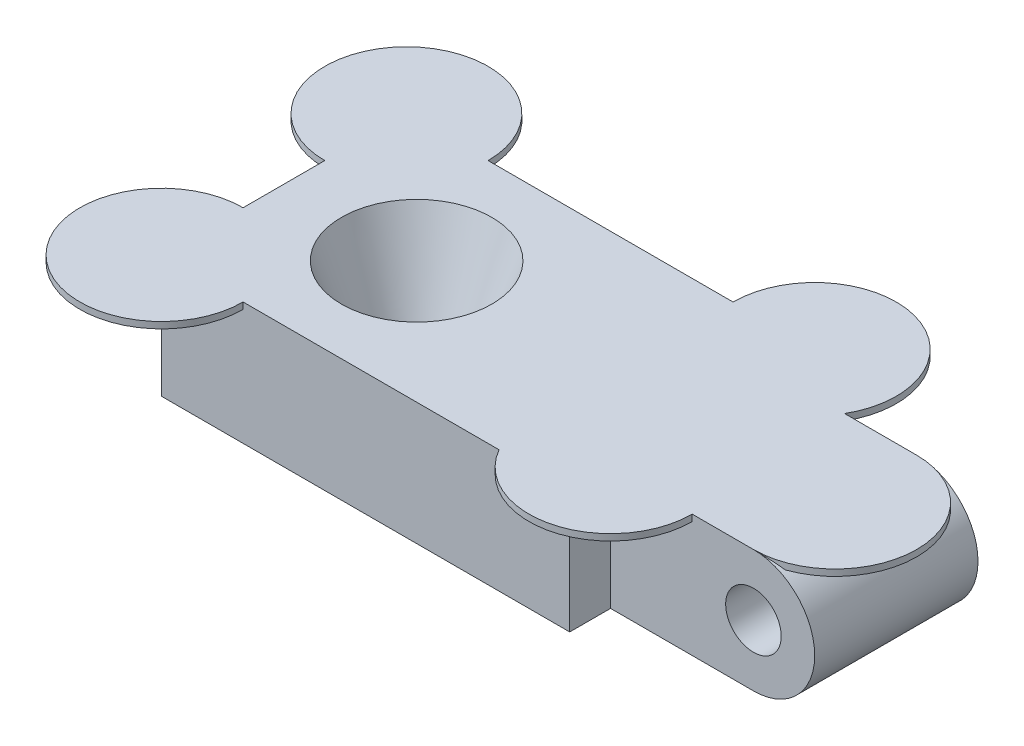
ISO-10303-21;
HEADER;
FILE_DESCRIPTION(('STEP AP214'),'2;1');
FILE_NAME('part.step','',(''),(''),'','','');
FILE_SCHEMA(('AUTOMOTIVE_DESIGN { 1 0 10303 214 1 1 1 1 }'));
ENDSEC;
DATA;
#1=APPLICATION_CONTEXT('core data for automotive mechanical design processes');
#2=APPLICATION_PROTOCOL_DEFINITION('international standard','automotive_design',2000,#1);
#3=PRODUCT_CONTEXT('',#1,'mechanical');
#4=PRODUCT('Part','Part','',(#3));
#5=PRODUCT_RELATED_PRODUCT_CATEGORY('part','',(#4));
#6=PRODUCT_DEFINITION_FORMATION('','',#4);
#7=PRODUCT_DEFINITION_CONTEXT('part definition',#1,'design');
#8=PRODUCT_DEFINITION('design','',#6,#7);
#9=PRODUCT_DEFINITION_SHAPE('','',#8);
#10=(LENGTH_UNIT() NAMED_UNIT(*) SI_UNIT(.MILLI.,.METRE.));
#11=(NAMED_UNIT(*) PLANE_ANGLE_UNIT() SI_UNIT($,.RADIAN.));
#12=(NAMED_UNIT(*) SI_UNIT($,.STERADIAN.) SOLID_ANGLE_UNIT());
#13=UNCERTAINTY_MEASURE_WITH_UNIT(LENGTH_MEASURE(1.E-05),#10,'distance_accuracy_value','');
#14=(GEOMETRIC_REPRESENTATION_CONTEXT(3) GLOBAL_UNCERTAINTY_ASSIGNED_CONTEXT((#13)) GLOBAL_UNIT_ASSIGNED_CONTEXT((#10,
#11,#12)) REPRESENTATION_CONTEXT('',''));
#15=CARTESIAN_POINT('',(0.,0.,0.));
#16=DIRECTION('',(0.,0.,1.));
#17=DIRECTION('',(1.,0.,0.));
#18=AXIS2_PLACEMENT_3D('',#15,#16,#17);
#19=CARTESIAN_POINT('',(8.255,3.81,10.16));
#20=DIRECTION('',(1.,0.,0.));
#21=DIRECTION('',(0.,0.,-1.));
#22=AXIS2_PLACEMENT_3D('',#19,#20,#21);
#23=PLANE('',#22);
#24=DIRECTION('',(0.,-1.,0.));
#25=VECTOR('',#24,1.);
#26=CARTESIAN_POINT('',(8.255,3.81,10.16));
#27=LINE('',#26,#25);
#28=CARTESIAN_POINT('',(8.255,3.41,10.16));
#29=VERTEX_POINT('',#28);
#30=CARTESIAN_POINT('',(8.255,-3.81,10.16));
#31=VERTEX_POINT('',#30);
#32=EDGE_CURVE('E249',#29,#31,#27,.T.);
#33=ORIENTED_EDGE('',*,*,#32,.F.);
#34=DIRECTION('',(0.,0.,1.));
#35=VECTOR('',#34,1.);
#36=CARTESIAN_POINT('',(8.255,3.41,10.16));
#37=LINE('',#36,#35);
#38=CARTESIAN_POINT('',(8.255,3.41,12.7));
#39=VERTEX_POINT('',#38);
#40=EDGE_CURVE('E42',#29,#39,#37,.T.);
#41=ORIENTED_EDGE('',*,*,#40,.T.);
#42=DIRECTION('',(0.,-1.,0.));
#43=VECTOR('',#42,1.);
#44=CARTESIAN_POINT('',(8.255,3.81,12.7));
#45=LINE('',#44,#43);
#46=CARTESIAN_POINT('',(8.255,-3.81,12.7));
#47=VERTEX_POINT('',#46);
#48=EDGE_CURVE('E255',#39,#47,#45,.T.);
#49=ORIENTED_EDGE('',*,*,#48,.T.);
#50=DIRECTION('',(0.,0.,1.));
#51=VECTOR('',#50,1.);
#52=CARTESIAN_POINT('',(8.255,-3.81,10.16));
#53=LINE('',#52,#51);
#54=EDGE_CURVE('E202',#31,#47,#53,.T.);
#55=ORIENTED_EDGE('',*,*,#54,.F.);
#56=EDGE_LOOP('',(#33,#41,#49,#55));
#57=FACE_BOUND('',#56,.T.);
#58=ADVANCED_FACE('F33',(#57),#23,.T.);
#59=CARTESIAN_POINT('',(8.25499999999998,3.81,0.));
#60=DIRECTION('',(1.,0.,0.));
#61=DIRECTION('',(0.,0.,-1.));
#62=AXIS2_PLACEMENT_3D('',#59,#60,#61);
#63=PLANE('',#62);
#64=DIRECTION('',(0.,-1.,0.));
#65=VECTOR('',#64,1.);
#66=CARTESIAN_POINT('',(8.25499999999998,3.81,-2.54));
#67=LINE('',#66,#65);
#68=CARTESIAN_POINT('',(8.25499999999998,3.41,-2.54));
#69=VERTEX_POINT('',#68);
#70=CARTESIAN_POINT('',(8.25499999999998,-3.81,-2.54));
#71=VERTEX_POINT('',#70);
#72=EDGE_CURVE('E236',#69,#71,#67,.T.);
#73=ORIENTED_EDGE('',*,*,#72,.F.);
#74=DIRECTION('',(0.,0.,1.));
#75=VECTOR('',#74,1.);
#76=CARTESIAN_POINT('',(8.25499999999998,3.41,0.));
#77=LINE('',#76,#75);
#78=CARTESIAN_POINT('',(8.25499999999998,3.41,0.));
#79=VERTEX_POINT('',#78);
#80=EDGE_CURVE('E309',#69,#79,#77,.T.);
#81=ORIENTED_EDGE('',*,*,#80,.T.);
#82=DIRECTION('',(0.,-1.,0.));
#83=VECTOR('',#82,1.);
#84=CARTESIAN_POINT('',(8.25499999999998,3.81,0.));
#85=LINE('',#84,#83);
#86=CARTESIAN_POINT('',(8.25499999999998,-3.81,0.));
#87=VERTEX_POINT('',#86);
#88=EDGE_CURVE('E206',#79,#87,#85,.T.);
#89=ORIENTED_EDGE('',*,*,#88,.T.);
#90=DIRECTION('',(0.,0.,1.));
#91=VECTOR('',#90,1.);
#92=CARTESIAN_POINT('',(8.25499999999998,-3.81,0.));
#93=LINE('',#92,#91);
#94=EDGE_CURVE('E317',#71,#87,#93,.T.);
#95=ORIENTED_EDGE('',*,*,#94,.F.);
#96=EDGE_LOOP('',(#73,#81,#89,#95));
#97=FACE_BOUND('',#96,.T.);
#98=ADVANCED_FACE('F325',(#97),#63,.T.);
#99=CARTESIAN_POINT('',(-8.89,-3.81,5.08));
#100=DIRECTION('',(0.,1.,0.));
#101=DIRECTION('',(0.,0.,1.));
#102=AXIS2_PLACEMENT_3D('',#99,#100,#101);
#103=CONICAL_SURFACE('',#102,1.905,0.349065850398867);
#104=CARTESIAN_POINT('',(-8.89,3.81,5.08));
#105=DIRECTION('',(0.,1.,0.));
#106=DIRECTION('',(0.,0.,1.));
#107=AXIS2_PLACEMENT_3D('',#104,#105,#106);
#108=CIRCLE('',#107,4.67845318510847);
#109=CARTESIAN_POINT('',(-8.89,3.81,9.75845318510847));
#110=VERTEX_POINT('',#109);
#111=EDGE_CURVE('E339',#110,#110,#108,.T.);
#112=ORIENTED_EDGE('',*,*,#111,.T.);
#113=EDGE_LOOP('',(#112));
#114=FACE_BOUND('',#113,.T.);
#115=CARTESIAN_POINT('',(-8.89,-2.54,5.08));
#116=DIRECTION('',(0.,-1.,0.));
#117=DIRECTION('',(0.,0.,-1.));
#118=AXIS2_PLACEMENT_3D('',#115,#116,#117);
#119=CIRCLE('',#118,2.36724219751808);
#120=CARTESIAN_POINT('',(-8.89,-2.54,2.71275780248192));
#121=VERTEX_POINT('',#120);
#122=EDGE_CURVE('E198',#121,#121,#119,.T.);
#123=ORIENTED_EDGE('',*,*,#122,.T.);
#124=EDGE_LOOP('',(#123));
#125=FACE_BOUND('',#124,.T.);
#126=ADVANCED_FACE('F353',(#114,#125),#103,.F.);
#127=CARTESIAN_POINT('',(-17.145,3.81,10.16));
#128=DIRECTION('',(0.,-1.,0.));
#129=DIRECTION('',(0.,0.,-1.));
#130=AXIS2_PLACEMENT_3D('',#127,#128,#129);
#131=PLANE('',#130);
#132=DIRECTION('',(-1.,0.,0.));
#133=VECTOR('',#132,1.);
#134=CARTESIAN_POINT('',(-17.145,3.81,10.16));
#135=LINE('',#134,#133);
#136=CARTESIAN_POINT('',(17.145,3.81,10.16));
#137=VERTEX_POINT('',#136);
#138=CARTESIAN_POINT('',(13.335,3.81,10.16));
#139=VERTEX_POINT('',#138);
#140=EDGE_CURVE('E54',#137,#139,#135,.T.);
#141=ORIENTED_EDGE('',*,*,#140,.F.);
#142=CARTESIAN_POINT('',(17.145,3.81,5.08));
#143=DIRECTION('',(0.,1.,0.));
#144=DIRECTION('',(0.,0.,1.));
#145=AXIS2_PLACEMENT_3D('',#142,#143,#144);
#146=CIRCLE('',#145,5.08);
#147=CARTESIAN_POINT('',(17.145,3.81,0.));
#148=VERTEX_POINT('',#147);
#149=EDGE_CURVE('E151',#137,#148,#146,.T.);
#150=ORIENTED_EDGE('',*,*,#149,.T.);
#151=DIRECTION('',(-1.,0.,0.));
#152=VECTOR('',#151,1.);
#153=CARTESIAN_POINT('',(-17.145,3.81,0.));
#154=LINE('',#153,#152);
#155=CARTESIAN_POINT('',(12.6544090512249,3.81,0.));
#156=VERTEX_POINT('',#155);
#157=EDGE_CURVE('E186',#148,#156,#154,.T.);
#158=ORIENTED_EDGE('',*,*,#157,.T.);
#159=CARTESIAN_POINT('',(8.25499999999998,3.81,-2.54));
#160=DIRECTION('',(0.,1.,0.));
#161=DIRECTION('',(0.,0.,1.));
#162=AXIS2_PLACEMENT_3D('',#159,#160,#161);
#163=CIRCLE('',#162,5.08);
#164=CARTESIAN_POINT('',(3.17499999999998,3.81,-2.54));
#165=VERTEX_POINT('',#164);
#166=EDGE_CURVE('E300',#156,#165,#163,.T.);
#167=ORIENTED_EDGE('',*,*,#166,.T.);
#168=DIRECTION('',(1.,0.,0.));
#169=VECTOR('',#168,1.);
#170=CARTESIAN_POINT('',(-17.145,3.81,-2.54));
#171=LINE('',#170,#169);
#172=CARTESIAN_POINT('',(-12.065,3.81,-2.54));
#173=VERTEX_POINT('',#172);
#174=EDGE_CURVE('E246',#173,#165,#171,.T.);
#175=ORIENTED_EDGE('',*,*,#174,.F.);
#176=CARTESIAN_POINT('',(-17.145,3.81,-2.54));
#177=DIRECTION('',(0.,1.,0.));
#178=DIRECTION('',(0.,0.,1.));
#179=AXIS2_PLACEMENT_3D('',#176,#177,#178);
#180=CIRCLE('',#179,5.08);
#181=CARTESIAN_POINT('',(-17.145,3.81,2.54));
#182=VERTEX_POINT('',#181);
#183=EDGE_CURVE('E428',#173,#182,#180,.T.);
#184=ORIENTED_EDGE('',*,*,#183,.T.);
#185=DIRECTION('',(0.,0.,-1.));
#186=VECTOR('',#185,1.);
#187=CARTESIAN_POINT('',(-17.145,3.81,10.16));
#188=LINE('',#187,#186);
#189=CARTESIAN_POINT('',(-17.145,3.81,7.62));
#190=VERTEX_POINT('',#189);
#191=EDGE_CURVE('E218',#190,#182,#188,.T.);
#192=ORIENTED_EDGE('',*,*,#191,.F.);
#193=CARTESIAN_POINT('',(-17.145,3.81,12.7));
#194=DIRECTION('',(0.,1.,0.));
#195=DIRECTION('',(0.,0.,1.));
#196=AXIS2_PLACEMENT_3D('',#193,#194,#195);
#197=CIRCLE('',#196,5.08);
#198=CARTESIAN_POINT('',(-12.065,3.81,12.7));
#199=VERTEX_POINT('',#198);
#200=EDGE_CURVE('E302',#190,#199,#197,.T.);
#201=ORIENTED_EDGE('',*,*,#200,.T.);
#202=DIRECTION('',(-1.,0.,0.));
#203=VECTOR('',#202,1.);
#204=CARTESIAN_POINT('',(-17.145,3.81,12.7));
#205=LINE('',#204,#203);
#206=CARTESIAN_POINT('',(3.85559094877505,3.81,12.7));
#207=VERTEX_POINT('',#206);
#208=EDGE_CURVE('E247',#207,#199,#205,.T.);
#209=ORIENTED_EDGE('',*,*,#208,.F.);
#210=CARTESIAN_POINT('',(8.255,3.81,10.16));
#211=DIRECTION('',(0.,1.,0.));
#212=DIRECTION('',(0.,0.,1.));
#213=AXIS2_PLACEMENT_3D('',#210,#211,#212);
#214=CIRCLE('',#213,5.08);
#215=EDGE_CURVE('E171',#207,#139,#214,.T.);
#216=ORIENTED_EDGE('',*,*,#215,.T.);
#217=EDGE_LOOP('',(#141,#150,#158,#167,#175,#184,#192,#201,#209,#216));
#218=FACE_BOUND('',#217,.T.);
#219=ORIENTED_EDGE('',*,*,#111,.F.);
#220=EDGE_LOOP('',(#219));
#221=FACE_BOUND('',#220,.T.);
#222=ADVANCED_FACE('F174',(#218,#221),#131,.F.);
#223=CARTESIAN_POINT('',(-17.145,-3.81,10.16));
#224=DIRECTION('',(0.,1.,0.));
#225=DIRECTION('',(0.,0.,1.));
#226=AXIS2_PLACEMENT_3D('',#223,#224,#225);
#227=PLANE('',#226);
#228=CARTESIAN_POINT('',(-8.89,-3.81,5.08));
#229=DIRECTION('',(0.,-1.,0.));
#230=DIRECTION('',(0.,0.,-1.));
#231=AXIS2_PLACEMENT_3D('',#228,#229,#230);
#232=CIRCLE('',#231,4.1275);
#233=CARTESIAN_POINT('',(-8.89,-3.81,0.9525));
#234=VERTEX_POINT('',#233);
#235=EDGE_CURVE('E254',#234,#234,#232,.T.);
#236=ORIENTED_EDGE('',*,*,#235,.F.);
#237=EDGE_LOOP('',(#236));
#238=FACE_BOUND('',#237,.T.);
#239=DIRECTION('',(0.,0.,-1.));
#240=VECTOR('',#239,1.);
#241=CARTESIAN_POINT('',(-17.145,-3.81,10.16));
#242=LINE('',#241,#240);
#243=CARTESIAN_POINT('',(-17.145,-3.81,12.7));
#244=VERTEX_POINT('',#243);
#245=CARTESIAN_POINT('',(-17.145,-3.81,-2.54));
#246=VERTEX_POINT('',#245);
#247=EDGE_CURVE('E216',#244,#246,#242,.T.);
#248=ORIENTED_EDGE('',*,*,#247,.T.);
#249=DIRECTION('',(1.,0.,0.));
#250=VECTOR('',#249,1.);
#251=CARTESIAN_POINT('',(-17.145,-3.81,-2.54));
#252=LINE('',#251,#250);
#253=EDGE_CURVE('E241',#246,#71,#252,.T.);
#254=ORIENTED_EDGE('',*,*,#253,.T.);
#255=ORIENTED_EDGE('',*,*,#94,.T.);
#256=DIRECTION('',(1.,0.,0.));
#257=VECTOR('',#256,1.);
#258=CARTESIAN_POINT('',(-17.145,-3.81,0.));
#259=LINE('',#258,#257);
#260=CARTESIAN_POINT('',(17.145,-3.81,0.));
#261=VERTEX_POINT('',#260);
#262=EDGE_CURVE('E184',#87,#261,#259,.T.);
#263=ORIENTED_EDGE('',*,*,#262,.T.);
#264=DIRECTION('',(0.,0.,-1.));
#265=VECTOR('',#264,1.);
#266=CARTESIAN_POINT('',(17.145,-3.81,10.16));
#267=LINE('',#266,#265);
#268=CARTESIAN_POINT('',(17.145,-3.81,10.16));
#269=VERTEX_POINT('',#268);
#270=EDGE_CURVE('E201',#269,#261,#267,.T.);
#271=ORIENTED_EDGE('',*,*,#270,.F.);
#272=DIRECTION('',(1.,0.,0.));
#273=VECTOR('',#272,1.);
#274=CARTESIAN_POINT('',(-17.145,-3.81,10.16));
#275=LINE('',#274,#273);
#276=EDGE_CURVE('E178',#31,#269,#275,.T.);
#277=ORIENTED_EDGE('',*,*,#276,.F.);
#278=ORIENTED_EDGE('',*,*,#54,.T.);
#279=DIRECTION('',(-1.,0.,0.));
#280=VECTOR('',#279,1.);
#281=CARTESIAN_POINT('',(-17.145,-3.81,12.7));
#282=LINE('',#281,#280);
#283=EDGE_CURVE('E205',#47,#244,#282,.T.);
#284=ORIENTED_EDGE('',*,*,#283,.T.);
#285=EDGE_LOOP('',(#248,#254,#255,#263,#271,#277,#278,#284));
#286=FACE_BOUND('',#285,.T.);
#287=ADVANCED_FACE('F323',(#238,#286),#227,.F.);
#288=CARTESIAN_POINT('',(17.145,0.,10.16));
#289=DIRECTION('',(0.,0.,-1.));
#290=DIRECTION('',(-1.,0.,0.));
#291=AXIS2_PLACEMENT_3D('',#288,#289,#290);
#292=CYLINDRICAL_SURFACE('',#291,3.81);
#293=CARTESIAN_POINT('',(17.145,0.,0.));
#294=DIRECTION('',(0.,0.,1.));
#295=DIRECTION('',(-1.,0.,0.));
#296=AXIS2_PLACEMENT_3D('',#293,#294,#295);
#297=CIRCLE('',#296,3.81);
#298=EDGE_CURVE('E334',#261,#148,#297,.T.);
#299=ORIENTED_EDGE('',*,*,#298,.T.);
#300=CARTESIAN_POINT('',(17.145,3.81,0.));
#301=CARTESIAN_POINT('',(17.2377963159208,3.81001991545679,-2.11542242013279E-05));
#302=CARTESIAN_POINT('',(17.3305805547833,3.80661066962651,0.00254182948299146));
#303=CARTESIAN_POINT('',(17.5153519348237,3.79308268585695,0.012679261670594));
#304=CARTESIAN_POINT('',(17.6073393470088,3.78296632774395,0.0202519326052025));
#305=CARTESIAN_POINT('',(17.7877744805755,3.75647179121953,0.0400289168476915));
#306=CARTESIAN_POINT('',(17.8762553805228,3.74023842618025,0.0521260721077433));
#307=CARTESIAN_POINT('',(18.0511529105807,3.70175687671674,0.0806861821608146));
#308=CARTESIAN_POINT('',(18.1375699414373,3.67950987048028,0.0971482817653769));
#309=CARTESIAN_POINT('',(18.330250133983,3.62268435936516,0.138980658861658));
#310=CARTESIAN_POINT('',(18.4357504850409,3.58640135241197,0.165555167802785));
#311=CARTESIAN_POINT('',(18.6433371632921,3.50481815022505,0.224767521430482));
#312=CARTESIAN_POINT('',(18.7453517948398,3.45939482091313,0.257487706066063));
#313=CARTESIAN_POINT('',(18.8444116628998,3.41,0.2926834238793));
#314=B_SPLINE_CURVE_WITH_KNOTS('',3,(#300,#301,#302,#303,#304,#305,#306,#307,#308,#309,#310,
#311,#312,#313),.UNSPECIFIED.,.F.,.F.,(4,2,2,2,2,2,4),(0.,0.278272151875352,0.55644561966888,
0.8284098516036,1.10032083909393,1.44379708209441,1.79225430633388),.UNSPECIFIED.);
#315=CARTESIAN_POINT('',(18.8444116628998,3.41,0.292683423879301));
#316=VERTEX_POINT('',#315);
#317=EDGE_CURVE('E158',#148,#316,#314,.T.);
#318=ORIENTED_EDGE('',*,*,#317,.T.);
#319=DIRECTION('',(0.,0.,-1.));
#320=VECTOR('',#319,1.);
#321=CARTESIAN_POINT('',(18.8444116628998,3.41,10.16));
#322=LINE('',#321,#320);
#323=CARTESIAN_POINT('',(18.8444116628998,3.41,9.8673165761207));
#324=VERTEX_POINT('',#323);
#325=EDGE_CURVE('E170',#324,#316,#322,.T.);
#326=ORIENTED_EDGE('',*,*,#325,.F.);
#327=CARTESIAN_POINT('',(18.8444116628998,3.41,9.8673165761207));
#328=CARTESIAN_POINT('',(18.7652313511925,3.44946873942817,9.89543492049315));
#329=CARTESIAN_POINT('',(18.6841960880048,3.48640192970204,9.92197821201027));
#330=CARTESIAN_POINT('',(18.5187208148137,3.55485613262136,9.97149573495837));
#331=CARTESIAN_POINT('',(18.4342775362678,3.58637178944175,9.99446643237704));
#332=CARTESIAN_POINT('',(18.2644508894996,3.64290423392653,10.0358745681827));
#333=CARTESIAN_POINT('',(18.1791352976442,3.66805536548728,10.0544051814436));
#334=CARTESIAN_POINT('',(18.0062458677922,3.71245479544986,10.087234475246));
#335=CARTESIAN_POINT('',(17.918673380558,3.73170653962533,10.1015356260036));
#336=CARTESIAN_POINT('',(17.7187516847608,3.76825234944792,10.128746096307));
#337=CARTESIAN_POINT('',(17.6058758467984,3.78373864378795,10.1403287315193));
#338=CARTESIAN_POINT('',(17.4346800624609,3.79941377148158,10.1520641424086));
#339=CARTESIAN_POINT('',(17.3768610708409,3.80338029958099,10.1550366797151));
#340=CARTESIAN_POINT('',(17.261032816945,3.80867394633874,10.1590053648562));
#341=CARTESIAN_POINT('',(17.2030235479738,3.81000097110322,10.1600014423832));
#342=CARTESIAN_POINT('',(17.145,3.81,10.16));
#343=B_SPLINE_CURVE_WITH_KNOTS('',3,(#327,#328,#329,#330,#331,#332,#333,#334,#335,#336,#337,
#338,#339,#340,#341,#342),.UNSPECIFIED.,.F.,.F.,(4,2,2,2,2,2,2,4),(0.,0.278473059808421,
0.557219856923981,0.829470203372826,1.10156122665128,1.44433580890378,1.61834845780598,
1.7923672966707),.UNSPECIFIED.);
#344=EDGE_CURVE('E155',#324,#137,#343,.T.);
#345=ORIENTED_EDGE('',*,*,#344,.T.);
#346=CARTESIAN_POINT('',(17.145,0.,10.16));
#347=DIRECTION('',(0.,0.,1.));
#348=DIRECTION('',(-1.,0.,0.));
#349=AXIS2_PLACEMENT_3D('',#346,#347,#348);
#350=CIRCLE('',#349,3.81);
#351=EDGE_CURVE('E169',#269,#137,#350,.T.);
#352=ORIENTED_EDGE('',*,*,#351,.F.);
#353=ORIENTED_EDGE('',*,*,#270,.T.);
#354=EDGE_LOOP('',(#299,#318,#326,#345,#352,#353));
#355=FACE_BOUND('',#354,.T.);
#356=ADVANCED_FACE('F35',(#355),#292,.T.);
#357=CARTESIAN_POINT('',(-17.145,-3.81,10.16));
#358=DIRECTION('',(1.,0.,0.));
#359=DIRECTION('',(0.,0.,-1.));
#360=AXIS2_PLACEMENT_3D('',#357,#358,#359);
#361=PLANE('',#360);
#362=ORIENTED_EDGE('',*,*,#191,.T.);
#363=DIRECTION('',(0.,1.,0.));
#364=VECTOR('',#363,1.);
#365=CARTESIAN_POINT('',(-17.145,3.41,2.54));
#366=LINE('',#365,#364);
#367=CARTESIAN_POINT('',(-17.145,3.41,2.54));
#368=VERTEX_POINT('',#367);
#369=EDGE_CURVE('E436',#182,#368,#366,.F.);
#370=ORIENTED_EDGE('',*,*,#369,.T.);
#371=DIRECTION('',(0.,0.,1.));
#372=VECTOR('',#371,1.);
#373=CARTESIAN_POINT('',(-17.145,3.41,10.16));
#374=LINE('',#373,#372);
#375=CARTESIAN_POINT('',(-17.145,3.41,-2.54));
#376=VERTEX_POINT('',#375);
#377=EDGE_CURVE('E431',#376,#368,#374,.T.);
#378=ORIENTED_EDGE('',*,*,#377,.F.);
#379=DIRECTION('',(0.,-1.,0.));
#380=VECTOR('',#379,1.);
#381=CARTESIAN_POINT('',(-17.145,3.81,-2.54));
#382=LINE('',#381,#380);
#383=EDGE_CURVE('E244',#376,#246,#382,.T.);
#384=ORIENTED_EDGE('',*,*,#383,.T.);
#385=ORIENTED_EDGE('',*,*,#247,.F.);
#386=DIRECTION('',(0.,-1.,0.));
#387=VECTOR('',#386,1.);
#388=CARTESIAN_POINT('',(-17.145,3.81,12.7));
#389=LINE('',#388,#387);
#390=CARTESIAN_POINT('',(-17.145,3.41,12.7));
#391=VERTEX_POINT('',#390);
#392=EDGE_CURVE('E252',#391,#244,#389,.T.);
#393=ORIENTED_EDGE('',*,*,#392,.F.);
#394=DIRECTION('',(0.,0.,1.));
#395=VECTOR('',#394,1.);
#396=CARTESIAN_POINT('',(-17.145,3.41,10.16));
#397=LINE('',#396,#395);
#398=CARTESIAN_POINT('',(-17.145,3.41,7.62));
#399=VERTEX_POINT('',#398);
#400=EDGE_CURVE('E294',#399,#391,#397,.T.);
#401=ORIENTED_EDGE('',*,*,#400,.F.);
#402=DIRECTION('',(0.,1.,0.));
#403=VECTOR('',#402,1.);
#404=CARTESIAN_POINT('',(-17.145,3.41,7.62));
#405=LINE('',#404,#403);
#406=EDGE_CURVE('E298',#399,#190,#405,.T.);
#407=ORIENTED_EDGE('',*,*,#406,.T.);
#408=EDGE_LOOP('',(#362,#370,#378,#384,#385,#393,#401,#407));
#409=FACE_BOUND('',#408,.T.);
#410=ADVANCED_FACE('F293',(#409),#361,.F.);
#411=CARTESIAN_POINT('',(17.145,0.,10.16));
#412=DIRECTION('',(0.,0.,-1.));
#413=DIRECTION('',(-1.,0.,0.));
#414=AXIS2_PLACEMENT_3D('',#411,#412,#413);
#415=PLANE('',#414);
#416=ORIENTED_EDGE('',*,*,#351,.T.);
#417=ORIENTED_EDGE('',*,*,#140,.T.);
#418=DIRECTION('',(0.,1.,0.));
#419=VECTOR('',#418,1.);
#420=CARTESIAN_POINT('',(13.335,3.41,10.16));
#421=LINE('',#420,#419);
#422=CARTESIAN_POINT('',(13.335,3.41,10.16));
#423=VERTEX_POINT('',#422);
#424=EDGE_CURVE('E49',#139,#423,#421,.F.);
#425=ORIENTED_EDGE('',*,*,#424,.T.);
#426=DIRECTION('',(1.,0.,0.));
#427=VECTOR('',#426,1.);
#428=CARTESIAN_POINT('',(17.145,3.41,10.16));
#429=LINE('',#428,#427);
#430=EDGE_CURVE('E425',#29,#423,#429,.T.);
#431=ORIENTED_EDGE('',*,*,#430,.F.);
#432=ORIENTED_EDGE('',*,*,#32,.T.);
#433=ORIENTED_EDGE('',*,*,#276,.T.);
#434=EDGE_LOOP('',(#416,#417,#425,#431,#432,#433));
#435=FACE_BOUND('',#434,.T.);
#436=CARTESIAN_POINT('',(17.145,0.,10.16));
#437=DIRECTION('',(0.,0.,1.));
#438=DIRECTION('',(1.,0.,0.));
#439=AXIS2_PLACEMENT_3D('',#436,#437,#438);
#440=CIRCLE('',#439,1.72719999999999);
#441=CARTESIAN_POINT('',(18.8722,0.,10.16));
#442=VERTEX_POINT('',#441);
#443=EDGE_CURVE('E336',#442,#442,#440,.T.);
#444=ORIENTED_EDGE('',*,*,#443,.F.);
#445=EDGE_LOOP('',(#444));
#446=FACE_BOUND('',#445,.T.);
#447=ADVANCED_FACE('F180',(#435,#446),#415,.F.);
#448=CARTESIAN_POINT('',(17.145,0.,0.));
#449=DIRECTION('',(0.,0.,-1.));
#450=DIRECTION('',(-1.,0.,0.));
#451=AXIS2_PLACEMENT_3D('',#448,#449,#450);
#452=PLANE('',#451);
#453=ORIENTED_EDGE('',*,*,#157,.F.);
#454=ORIENTED_EDGE('',*,*,#298,.F.);
#455=ORIENTED_EDGE('',*,*,#262,.F.);
#456=ORIENTED_EDGE('',*,*,#88,.F.);
#457=DIRECTION('',(1.,0.,0.));
#458=VECTOR('',#457,1.);
#459=CARTESIAN_POINT('',(17.145,3.41,0.));
#460=LINE('',#459,#458);
#461=CARTESIAN_POINT('',(12.6544090512249,3.41,0.));
#462=VERTEX_POINT('',#461);
#463=EDGE_CURVE('E313',#79,#462,#460,.T.);
#464=ORIENTED_EDGE('',*,*,#463,.T.);
#465=DIRECTION('',(0.,1.,0.));
#466=VECTOR('',#465,1.);
#467=CARTESIAN_POINT('',(12.6544090512249,3.41,0.));
#468=LINE('',#467,#466);
#469=EDGE_CURVE('E315',#156,#462,#468,.F.);
#470=ORIENTED_EDGE('',*,*,#469,.F.);
#471=EDGE_LOOP('',(#453,#454,#455,#456,#464,#470));
#472=FACE_BOUND('',#471,.T.);
#473=CARTESIAN_POINT('',(17.145,0.,0.));
#474=DIRECTION('',(0.,0.,1.));
#475=DIRECTION('',(1.,0.,0.));
#476=AXIS2_PLACEMENT_3D('',#473,#474,#475);
#477=CIRCLE('',#476,1.7272);
#478=CARTESIAN_POINT('',(18.8722,0.,0.));
#479=VERTEX_POINT('',#478);
#480=EDGE_CURVE('E190',#479,#479,#477,.T.);
#481=ORIENTED_EDGE('',*,*,#480,.T.);
#482=EDGE_LOOP('',(#481));
#483=FACE_BOUND('',#482,.T.);
#484=ADVANCED_FACE('F332',(#472,#483),#452,.T.);
#485=CARTESIAN_POINT('',(17.145,0.,10.16));
#486=DIRECTION('',(0.,0.,1.));
#487=DIRECTION('',(1.,0.,0.));
#488=AXIS2_PLACEMENT_3D('',#485,#486,#487);
#489=CYLINDRICAL_SURFACE('',#488,1.72719999999999);
#490=ORIENTED_EDGE('',*,*,#480,.F.);
#491=EDGE_LOOP('',(#490));
#492=FACE_BOUND('',#491,.T.);
#493=ORIENTED_EDGE('',*,*,#443,.T.);
#494=EDGE_LOOP('',(#493));
#495=FACE_BOUND('',#494,.T.);
#496=ADVANCED_FACE('F365',(#492,#495),#489,.F.);
#497=CARTESIAN_POINT('',(-8.89,-2.54,5.08));
#498=DIRECTION('',(0.,-1.,0.));
#499=DIRECTION('',(0.,0.,-1.));
#500=AXIS2_PLACEMENT_3D('',#497,#498,#499);
#501=CYLINDRICAL_SURFACE('',#500,4.1275);
#502=CARTESIAN_POINT('',(-8.89,-2.54,5.08));
#503=DIRECTION('',(0.,-1.,0.));
#504=DIRECTION('',(0.,0.,-1.));
#505=AXIS2_PLACEMENT_3D('',#502,#503,#504);
#506=CIRCLE('',#505,4.1275);
#507=CARTESIAN_POINT('',(-8.89,-2.54,0.9525));
#508=VERTEX_POINT('',#507);
#509=EDGE_CURVE('E259',#508,#508,#506,.T.);
#510=ORIENTED_EDGE('',*,*,#509,.F.);
#511=EDGE_LOOP('',(#510));
#512=FACE_BOUND('',#511,.T.);
#513=ORIENTED_EDGE('',*,*,#235,.T.);
#514=EDGE_LOOP('',(#513));
#515=FACE_BOUND('',#514,.T.);
#516=ADVANCED_FACE('F357',(#512,#515),#501,.F.);
#517=CARTESIAN_POINT('',(-8.89,-2.54,5.08));
#518=DIRECTION('',(0.,-1.,0.));
#519=DIRECTION('',(0.,0.,-1.));
#520=AXIS2_PLACEMENT_3D('',#517,#518,#519);
#521=PLANE('',#520);
#522=ORIENTED_EDGE('',*,*,#122,.F.);
#523=EDGE_LOOP('',(#522));
#524=FACE_BOUND('',#523,.T.);
#525=ORIENTED_EDGE('',*,*,#509,.T.);
#526=EDGE_LOOP('',(#525));
#527=FACE_BOUND('',#526,.T.);
#528=ADVANCED_FACE('F355',(#524,#527),#521,.T.);
#529=CARTESIAN_POINT('',(-17.145,3.81,12.7));
#530=DIRECTION('',(0.,0.,1.));
#531=DIRECTION('',(1.,0.,0.));
#532=AXIS2_PLACEMENT_3D('',#529,#530,#531);
#533=PLANE('',#532);
#534=DIRECTION('',(0.,1.,0.));
#535=VECTOR('',#534,1.);
#536=CARTESIAN_POINT('',(3.85559094877505,3.41,12.7));
#537=LINE('',#536,#535);
#538=CARTESIAN_POINT('',(3.85559094877505,3.41,12.7));
#539=VERTEX_POINT('',#538);
#540=EDGE_CURVE('E11',#207,#539,#537,.F.);
#541=ORIENTED_EDGE('',*,*,#540,.F.);
#542=ORIENTED_EDGE('',*,*,#208,.T.);
#543=DIRECTION('',(0.,1.,0.));
#544=VECTOR('',#543,1.);
#545=CARTESIAN_POINT('',(-12.065,3.41,12.7));
#546=LINE('',#545,#544);
#547=CARTESIAN_POINT('',(-12.065,3.41,12.7));
#548=VERTEX_POINT('',#547);
#549=EDGE_CURVE('E276',#548,#199,#546,.T.);
#550=ORIENTED_EDGE('',*,*,#549,.F.);
#551=DIRECTION('',(-1.,0.,0.));
#552=VECTOR('',#551,1.);
#553=CARTESIAN_POINT('',(-17.145,3.41,12.7));
#554=LINE('',#553,#552);
#555=EDGE_CURVE('E229',#548,#391,#554,.T.);
#556=ORIENTED_EDGE('',*,*,#555,.T.);
#557=ORIENTED_EDGE('',*,*,#392,.T.);
#558=ORIENTED_EDGE('',*,*,#283,.F.);
#559=ORIENTED_EDGE('',*,*,#48,.F.);
#560=DIRECTION('',(-1.,0.,0.));
#561=VECTOR('',#560,1.);
#562=CARTESIAN_POINT('',(-17.145,3.41,12.7));
#563=LINE('',#562,#561);
#564=EDGE_CURVE('E422',#39,#539,#563,.T.);
#565=ORIENTED_EDGE('',*,*,#564,.T.);
#566=EDGE_LOOP('',(#541,#542,#550,#556,#557,#558,#559,#565));
#567=FACE_BOUND('',#566,.T.);
#568=ADVANCED_FACE('F287',(#567),#533,.T.);
#569=CARTESIAN_POINT('',(-17.145,3.81,-2.54));
#570=DIRECTION('',(0.,0.,-1.));
#571=DIRECTION('',(-1.,0.,0.));
#572=AXIS2_PLACEMENT_3D('',#569,#570,#571);
#573=PLANE('',#572);
#574=DIRECTION('',(0.,1.,0.));
#575=VECTOR('',#574,1.);
#576=CARTESIAN_POINT('',(-12.065,3.41,-2.54));
#577=LINE('',#576,#575);
#578=CARTESIAN_POINT('',(-12.065,3.41,-2.54));
#579=VERTEX_POINT('',#578);
#580=EDGE_CURVE('E263',#173,#579,#577,.F.);
#581=ORIENTED_EDGE('',*,*,#580,.F.);
#582=ORIENTED_EDGE('',*,*,#174,.T.);
#583=DIRECTION('',(0.,1.,0.));
#584=VECTOR('',#583,1.);
#585=CARTESIAN_POINT('',(3.17499999999998,3.41,-2.54));
#586=LINE('',#585,#584);
#587=CARTESIAN_POINT('',(3.17499999999998,3.41,-2.54));
#588=VERTEX_POINT('',#587);
#589=EDGE_CURVE('E223',#588,#165,#586,.T.);
#590=ORIENTED_EDGE('',*,*,#589,.F.);
#591=DIRECTION('',(1.,0.,0.));
#592=VECTOR('',#591,1.);
#593=CARTESIAN_POINT('',(-17.145,3.41,-2.54));
#594=LINE('',#593,#592);
#595=EDGE_CURVE('E219',#588,#69,#594,.T.);
#596=ORIENTED_EDGE('',*,*,#595,.T.);
#597=ORIENTED_EDGE('',*,*,#72,.T.);
#598=ORIENTED_EDGE('',*,*,#253,.F.);
#599=ORIENTED_EDGE('',*,*,#383,.F.);
#600=DIRECTION('',(1.,0.,0.));
#601=VECTOR('',#600,1.);
#602=CARTESIAN_POINT('',(-17.145,3.41,-2.54));
#603=LINE('',#602,#601);
#604=EDGE_CURVE('E270',#376,#579,#603,.T.);
#605=ORIENTED_EDGE('',*,*,#604,.T.);
#606=EDGE_LOOP('',(#581,#582,#590,#596,#597,#598,#599,#605));
#607=FACE_BOUND('',#606,.T.);
#608=ADVANCED_FACE('F363',(#607),#573,.T.);
#609=CARTESIAN_POINT('',(8.25499999999998,3.41,-2.54));
#610=DIRECTION('',(0.,1.,0.));
#611=DIRECTION('',(0.,0.,1.));
#612=AXIS2_PLACEMENT_3D('',#609,#610,#611);
#613=CYLINDRICAL_SURFACE('',#612,5.08);
#614=ORIENTED_EDGE('',*,*,#166,.F.);
#615=ORIENTED_EDGE('',*,*,#469,.T.);
#616=CARTESIAN_POINT('',(8.25499999999998,3.41,-2.54));
#617=DIRECTION('',(0.,1.,0.));
#618=DIRECTION('',(0.,0.,1.));
#619=AXIS2_PLACEMENT_3D('',#616,#617,#618);
#620=CIRCLE('',#619,5.08);
#621=EDGE_CURVE('E306',#462,#588,#620,.T.);
#622=ORIENTED_EDGE('',*,*,#621,.T.);
#623=ORIENTED_EDGE('',*,*,#589,.T.);
#624=EDGE_LOOP('',(#614,#615,#622,#623));
#625=FACE_BOUND('',#624,.T.);
#626=ADVANCED_FACE('F376',(#625),#613,.T.);
#627=CARTESIAN_POINT('',(8.25499999999998,3.41,-2.54));
#628=DIRECTION('',(0.,1.,0.));
#629=DIRECTION('',(0.,0.,1.));
#630=AXIS2_PLACEMENT_3D('',#627,#628,#629);
#631=PLANE('',#630);
#632=ORIENTED_EDGE('',*,*,#463,.F.);
#633=ORIENTED_EDGE('',*,*,#80,.F.);
#634=ORIENTED_EDGE('',*,*,#595,.F.);
#635=ORIENTED_EDGE('',*,*,#621,.F.);
#636=EDGE_LOOP('',(#632,#633,#634,#635));
#637=FACE_BOUND('',#636,.T.);
#638=ADVANCED_FACE('F380',(#637),#631,.F.);
#639=CARTESIAN_POINT('',(-17.145,3.41,12.7));
#640=DIRECTION('',(0.,1.,0.));
#641=DIRECTION('',(0.,0.,1.));
#642=AXIS2_PLACEMENT_3D('',#639,#640,#641);
#643=CYLINDRICAL_SURFACE('',#642,5.08);
#644=ORIENTED_EDGE('',*,*,#406,.F.);
#645=CARTESIAN_POINT('',(-17.145,3.41,12.7));
#646=DIRECTION('',(0.,1.,0.));
#647=DIRECTION('',(0.,0.,1.));
#648=AXIS2_PLACEMENT_3D('',#645,#646,#647);
#649=CIRCLE('',#648,5.08);
#650=EDGE_CURVE('E297',#399,#548,#649,.T.);
#651=ORIENTED_EDGE('',*,*,#650,.T.);
#652=ORIENTED_EDGE('',*,*,#549,.T.);
#653=ORIENTED_EDGE('',*,*,#200,.F.);
#654=EDGE_LOOP('',(#644,#651,#652,#653));
#655=FACE_BOUND('',#654,.T.);
#656=ADVANCED_FACE('F384',(#655),#643,.T.);
#657=CARTESIAN_POINT('',(-17.145,3.41,12.7));
#658=DIRECTION('',(0.,1.,0.));
#659=DIRECTION('',(0.,0.,1.));
#660=AXIS2_PLACEMENT_3D('',#657,#658,#659);
#661=PLANE('',#660);
#662=ORIENTED_EDGE('',*,*,#650,.F.);
#663=ORIENTED_EDGE('',*,*,#400,.T.);
#664=ORIENTED_EDGE('',*,*,#555,.F.);
#665=EDGE_LOOP('',(#662,#663,#664));
#666=FACE_BOUND('',#665,.T.);
#667=ADVANCED_FACE('F296',(#666),#661,.F.);
#668=CARTESIAN_POINT('',(-17.145,3.41,-2.54));
#669=DIRECTION('',(0.,1.,0.));
#670=DIRECTION('',(0.,0.,1.));
#671=AXIS2_PLACEMENT_3D('',#668,#669,#670);
#672=CYLINDRICAL_SURFACE('',#671,5.08);
#673=ORIENTED_EDGE('',*,*,#369,.F.);
#674=ORIENTED_EDGE('',*,*,#183,.F.);
#675=ORIENTED_EDGE('',*,*,#580,.T.);
#676=CARTESIAN_POINT('',(-17.145,3.41,-2.54));
#677=DIRECTION('',(0.,1.,0.));
#678=DIRECTION('',(0.,0.,1.));
#679=AXIS2_PLACEMENT_3D('',#676,#677,#678);
#680=CIRCLE('',#679,5.08);
#681=EDGE_CURVE('E429',#579,#368,#680,.T.);
#682=ORIENTED_EDGE('',*,*,#681,.T.);
#683=EDGE_LOOP('',(#673,#674,#675,#682));
#684=FACE_BOUND('',#683,.T.);
#685=ADVANCED_FACE('F390',(#684),#672,.T.);
#686=CARTESIAN_POINT('',(-17.145,3.41,-2.54));
#687=DIRECTION('',(0.,1.,0.));
#688=DIRECTION('',(0.,0.,1.));
#689=AXIS2_PLACEMENT_3D('',#686,#687,#688);
#690=PLANE('',#689);
#691=ORIENTED_EDGE('',*,*,#604,.F.);
#692=ORIENTED_EDGE('',*,*,#377,.T.);
#693=ORIENTED_EDGE('',*,*,#681,.F.);
#694=EDGE_LOOP('',(#691,#692,#693));
#695=FACE_BOUND('',#694,.T.);
#696=ADVANCED_FACE('F393',(#695),#690,.F.);
#697=CARTESIAN_POINT('',(8.255,3.41,10.16));
#698=DIRECTION('',(0.,1.,0.));
#699=DIRECTION('',(0.,0.,1.));
#700=AXIS2_PLACEMENT_3D('',#697,#698,#699);
#701=CYLINDRICAL_SURFACE('',#700,5.08);
#702=ORIENTED_EDGE('',*,*,#424,.F.);
#703=ORIENTED_EDGE('',*,*,#215,.F.);
#704=ORIENTED_EDGE('',*,*,#540,.T.);
#705=CARTESIAN_POINT('',(8.255,3.41,10.16));
#706=DIRECTION('',(0.,1.,0.));
#707=DIRECTION('',(0.,0.,1.));
#708=AXIS2_PLACEMENT_3D('',#705,#706,#707);
#709=CIRCLE('',#708,5.08);
#710=EDGE_CURVE('E419',#539,#423,#709,.T.);
#711=ORIENTED_EDGE('',*,*,#710,.T.);
#712=EDGE_LOOP('',(#702,#703,#704,#711));
#713=FACE_BOUND('',#712,.T.);
#714=ADVANCED_FACE('F396',(#713),#701,.T.);
#715=CARTESIAN_POINT('',(8.255,3.41,10.16));
#716=DIRECTION('',(0.,1.,0.));
#717=DIRECTION('',(0.,0.,1.));
#718=AXIS2_PLACEMENT_3D('',#715,#716,#717);
#719=PLANE('',#718);
#720=ORIENTED_EDGE('',*,*,#40,.F.);
#721=ORIENTED_EDGE('',*,*,#430,.T.);
#722=ORIENTED_EDGE('',*,*,#710,.F.);
#723=ORIENTED_EDGE('',*,*,#564,.F.);
#724=EDGE_LOOP('',(#720,#721,#722,#723));
#725=FACE_BOUND('',#724,.T.);
#726=ADVANCED_FACE('F400',(#725),#719,.F.);
#727=CARTESIAN_POINT('',(17.145,3.41,5.08));
#728=DIRECTION('',(0.,1.,0.));
#729=DIRECTION('',(0.,0.,1.));
#730=AXIS2_PLACEMENT_3D('',#727,#728,#729);
#731=CYLINDRICAL_SURFACE('',#730,5.08);
#732=ORIENTED_EDGE('',*,*,#344,.F.);
#733=CARTESIAN_POINT('',(17.145,3.41,5.08));
#734=DIRECTION('',(0.,1.,0.));
#735=DIRECTION('',(0.,0.,1.));
#736=AXIS2_PLACEMENT_3D('',#733,#734,#735);
#737=CIRCLE('',#736,5.08);
#738=EDGE_CURVE('E162',#324,#316,#737,.T.);
#739=ORIENTED_EDGE('',*,*,#738,.T.);
#740=ORIENTED_EDGE('',*,*,#317,.F.);
#741=ORIENTED_EDGE('',*,*,#149,.F.);
#742=EDGE_LOOP('',(#732,#739,#740,#741));
#743=FACE_BOUND('',#742,.T.);
#744=ADVANCED_FACE('F153',(#743),#731,.T.);
#745=CARTESIAN_POINT('',(17.145,3.41,5.08));
#746=DIRECTION('',(0.,1.,0.));
#747=DIRECTION('',(0.,0.,1.));
#748=AXIS2_PLACEMENT_3D('',#745,#746,#747);
#749=PLANE('',#748);
#750=ORIENTED_EDGE('',*,*,#738,.F.);
#751=ORIENTED_EDGE('',*,*,#325,.T.);
#752=EDGE_LOOP('',(#750,#751));
#753=FACE_BOUND('',#752,.T.);
#754=ADVANCED_FACE('F408',(#753),#749,.F.);
#755=CLOSED_SHELL('',(#58,#98,#126,#222,#287,#356,#410,#447,#484,#496,#516,#528,#568,#608,#626,
#638,#656,#667,#685,#696,#714,#726,#744,#754));
#756=MANIFOLD_SOLID_BREP('B2',#755);
#757=ADVANCED_BREP_SHAPE_REPRESENTATION('',(#18,#756),#14);
#758=SHAPE_DEFINITION_REPRESENTATION(#9,#757);
ENDSEC;
END-ISO-10303-21;
